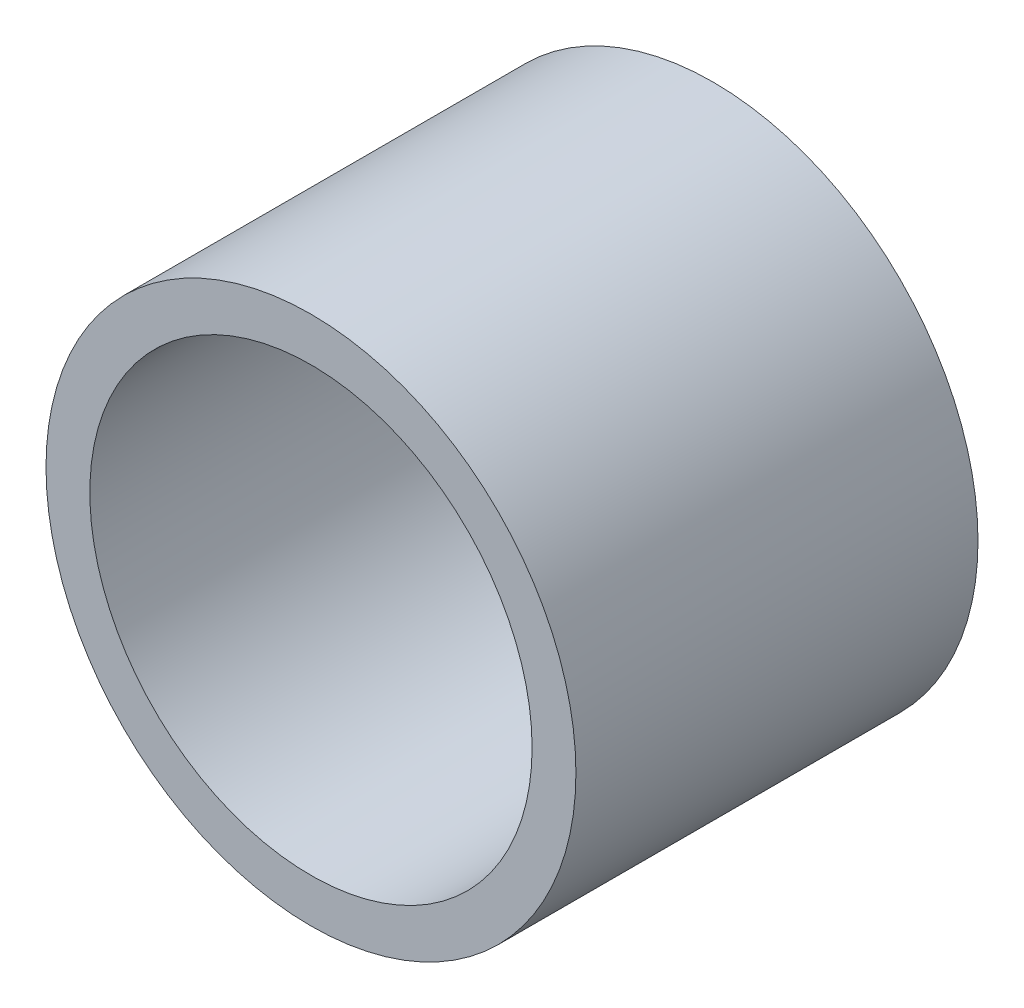
ISO-10303-21;
HEADER;
FILE_DESCRIPTION(('STEP AP214'),'2;1');
FILE_NAME('part.step','',(''),(''),'','','');
FILE_SCHEMA(('AUTOMOTIVE_DESIGN { 1 0 10303 214 1 1 1 1 }'));
ENDSEC;
DATA;
#1=APPLICATION_CONTEXT('core data for automotive mechanical design processes');
#2=APPLICATION_PROTOCOL_DEFINITION('international standard','automotive_design',2000,#1);
#3=PRODUCT_CONTEXT('',#1,'mechanical');
#4=PRODUCT('Part','Part','',(#3));
#5=PRODUCT_RELATED_PRODUCT_CATEGORY('part','',(#4));
#6=PRODUCT_DEFINITION_FORMATION('','',#4);
#7=PRODUCT_DEFINITION_CONTEXT('part definition',#1,'design');
#8=PRODUCT_DEFINITION('design','',#6,#7);
#9=PRODUCT_DEFINITION_SHAPE('','',#8);
#10=(LENGTH_UNIT() NAMED_UNIT(*) SI_UNIT(.MILLI.,.METRE.));
#11=(NAMED_UNIT(*) PLANE_ANGLE_UNIT() SI_UNIT($,.RADIAN.));
#12=(NAMED_UNIT(*) SI_UNIT($,.STERADIAN.) SOLID_ANGLE_UNIT());
#13=UNCERTAINTY_MEASURE_WITH_UNIT(LENGTH_MEASURE(1.E-05),#10,'distance_accuracy_value','');
#14=(GEOMETRIC_REPRESENTATION_CONTEXT(3) GLOBAL_UNCERTAINTY_ASSIGNED_CONTEXT((#13)) GLOBAL_UNIT_ASSIGNED_CONTEXT((#10,
#11,#12)) REPRESENTATION_CONTEXT('',''));
#15=CARTESIAN_POINT('',(0.,0.,0.));
#16=DIRECTION('',(0.,0.,1.));
#17=DIRECTION('',(1.,0.,0.));
#18=AXIS2_PLACEMENT_3D('',#15,#16,#17);
#19=CARTESIAN_POINT('',(0.,0.,50.));
#20=DIRECTION('',(0.,0.,1.));
#21=DIRECTION('',(1.,0.,0.));
#22=AXIS2_PLACEMENT_3D('',#19,#20,#21);
#23=PLANE('',#22);
#24=CARTESIAN_POINT('',(0.,0.,50.));
#25=DIRECTION('',(0.,0.,1.));
#26=DIRECTION('',(1.,0.,0.));
#27=AXIS2_PLACEMENT_3D('',#24,#25,#26);
#28=CIRCLE('',#27,32.95);
#29=CARTESIAN_POINT('',(32.95,0.,50.));
#30=VERTEX_POINT('',#29);
#31=EDGE_CURVE('E10',#30,#30,#28,.T.);
#32=ORIENTED_EDGE('',*,*,#31,.T.);
#33=EDGE_LOOP('',(#32));
#34=FACE_BOUND('',#33,.T.);
#35=CARTESIAN_POINT('',(0.,0.,50.));
#36=DIRECTION('',(0.,0.,1.));
#37=DIRECTION('',(1.,0.,0.));
#38=AXIS2_PLACEMENT_3D('',#35,#36,#37);
#39=CIRCLE('',#38,27.5);
#40=CARTESIAN_POINT('',(27.5,0.,50.));
#41=VERTEX_POINT('',#40);
#42=EDGE_CURVE('E48',#41,#41,#39,.T.);
#43=ORIENTED_EDGE('',*,*,#42,.F.);
#44=EDGE_LOOP('',(#43));
#45=FACE_BOUND('',#44,.T.);
#46=ADVANCED_FACE('F37',(#34,#45),#23,.T.);
#47=CARTESIAN_POINT('',(0.,0.,0.));
#48=DIRECTION('',(0.,0.,1.));
#49=DIRECTION('',(1.,0.,0.));
#50=AXIS2_PLACEMENT_3D('',#47,#48,#49);
#51=PLANE('',#50);
#52=CARTESIAN_POINT('',(0.,0.,0.));
#53=DIRECTION('',(0.,0.,1.));
#54=DIRECTION('',(1.,0.,0.));
#55=AXIS2_PLACEMENT_3D('',#52,#53,#54);
#56=CIRCLE('',#55,32.95);
#57=CARTESIAN_POINT('',(32.95,0.,0.));
#58=VERTEX_POINT('',#57);
#59=EDGE_CURVE('E41',#58,#58,#56,.T.);
#60=ORIENTED_EDGE('',*,*,#59,.F.);
#61=EDGE_LOOP('',(#60));
#62=FACE_BOUND('',#61,.T.);
#63=CARTESIAN_POINT('',(0.,0.,0.));
#64=DIRECTION('',(0.,0.,1.));
#65=DIRECTION('',(1.,0.,0.));
#66=AXIS2_PLACEMENT_3D('',#63,#64,#65);
#67=CIRCLE('',#66,27.5);
#68=CARTESIAN_POINT('',(27.5,0.,0.));
#69=VERTEX_POINT('',#68);
#70=EDGE_CURVE('E50',#69,#69,#67,.T.);
#71=ORIENTED_EDGE('',*,*,#70,.T.);
#72=EDGE_LOOP('',(#71));
#73=FACE_BOUND('',#72,.T.);
#74=ADVANCED_FACE('F60',(#62,#73),#51,.F.);
#75=CARTESIAN_POINT('',(0.,0.,50.));
#76=DIRECTION('',(0.,0.,-1.));
#77=DIRECTION('',(-1.,0.,0.));
#78=AXIS2_PLACEMENT_3D('',#75,#76,#77);
#79=CYLINDRICAL_SURFACE('',#78,32.95);
#80=ORIENTED_EDGE('',*,*,#31,.F.);
#81=EDGE_LOOP('',(#80));
#82=FACE_BOUND('',#81,.T.);
#83=ORIENTED_EDGE('',*,*,#59,.T.);
#84=EDGE_LOOP('',(#83));
#85=FACE_BOUND('',#84,.T.);
#86=ADVANCED_FACE('F39',(#82,#85),#79,.T.);
#87=CARTESIAN_POINT('',(0.,0.,50.));
#88=DIRECTION('',(0.,0.,-1.));
#89=DIRECTION('',(-1.,0.,0.));
#90=AXIS2_PLACEMENT_3D('',#87,#88,#89);
#91=CYLINDRICAL_SURFACE('',#90,27.5);
#92=ORIENTED_EDGE('',*,*,#42,.T.);
#93=EDGE_LOOP('',(#92));
#94=FACE_BOUND('',#93,.T.);
#95=ORIENTED_EDGE('',*,*,#70,.F.);
#96=EDGE_LOOP('',(#95));
#97=FACE_BOUND('',#96,.T.);
#98=ADVANCED_FACE('F56',(#94,#97),#91,.F.);
#99=CLOSED_SHELL('',(#46,#74,#86,#98));
#100=MANIFOLD_SOLID_BREP('B2',#99);
#101=ADVANCED_BREP_SHAPE_REPRESENTATION('',(#18,#100),#14);
#102=SHAPE_DEFINITION_REPRESENTATION(#9,#101);
ENDSEC;
END-ISO-10303-21;
